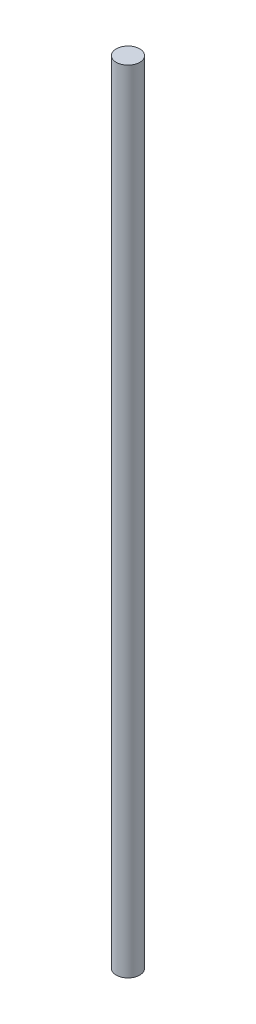
ISO-10303-21;
HEADER;
FILE_DESCRIPTION(('STEP AP214'),'2;1');
FILE_NAME('part.step','',(''),(''),'','','');
FILE_SCHEMA(('AUTOMOTIVE_DESIGN { 1 0 10303 214 1 1 1 1 }'));
ENDSEC;
DATA;
#1=APPLICATION_CONTEXT('core data for automotive mechanical design processes');
#2=APPLICATION_PROTOCOL_DEFINITION('international standard','automotive_design',2000,#1);
#3=PRODUCT_CONTEXT('',#1,'mechanical');
#4=PRODUCT('Part','Part','',(#3));
#5=PRODUCT_RELATED_PRODUCT_CATEGORY('part','',(#4));
#6=PRODUCT_DEFINITION_FORMATION('','',#4);
#7=PRODUCT_DEFINITION_CONTEXT('part definition',#1,'design');
#8=PRODUCT_DEFINITION('design','',#6,#7);
#9=PRODUCT_DEFINITION_SHAPE('','',#8);
#10=(LENGTH_UNIT() NAMED_UNIT(*) SI_UNIT(.MILLI.,.METRE.));
#11=(NAMED_UNIT(*) PLANE_ANGLE_UNIT() SI_UNIT($,.RADIAN.));
#12=(NAMED_UNIT(*) SI_UNIT($,.STERADIAN.) SOLID_ANGLE_UNIT());
#13=UNCERTAINTY_MEASURE_WITH_UNIT(LENGTH_MEASURE(1.E-05),#10,'distance_accuracy_value','');
#14=(GEOMETRIC_REPRESENTATION_CONTEXT(3) GLOBAL_UNCERTAINTY_ASSIGNED_CONTEXT((#13)) GLOBAL_UNIT_ASSIGNED_CONTEXT((#10,
#11,#12)) REPRESENTATION_CONTEXT('',''));
#15=CARTESIAN_POINT('',(0.,0.,0.));
#16=DIRECTION('',(0.,0.,1.));
#17=DIRECTION('',(1.,0.,0.));
#18=AXIS2_PLACEMENT_3D('',#15,#16,#17);
#19=CARTESIAN_POINT('',(0.,270.,0.));
#20=DIRECTION('',(0.,-1.,0.));
#21=DIRECTION('',(0.,0.,-1.));
#22=AXIS2_PLACEMENT_3D('',#19,#20,#21);
#23=CYLINDRICAL_SURFACE('',#22,4.);
#24=CARTESIAN_POINT('',(0.,270.,0.));
#25=DIRECTION('',(0.,1.,0.));
#26=DIRECTION('',(0.,0.,1.));
#27=AXIS2_PLACEMENT_3D('',#24,#25,#26);
#28=CIRCLE('',#27,4.);
#29=CARTESIAN_POINT('',(0.,270.,4.));
#30=VERTEX_POINT('',#29);
#31=EDGE_CURVE('E10',#30,#30,#28,.T.);
#32=ORIENTED_EDGE('',*,*,#31,.F.);
#33=EDGE_LOOP('',(#32));
#34=FACE_BOUND('',#33,.T.);
#35=CARTESIAN_POINT('',(0.,0.,0.));
#36=DIRECTION('',(0.,1.,0.));
#37=DIRECTION('',(0.,0.,1.));
#38=AXIS2_PLACEMENT_3D('',#35,#36,#37);
#39=CIRCLE('',#38,4.);
#40=CARTESIAN_POINT('',(0.,0.,4.));
#41=VERTEX_POINT('',#40);
#42=EDGE_CURVE('E36',#41,#41,#39,.T.);
#43=ORIENTED_EDGE('',*,*,#42,.T.);
#44=EDGE_LOOP('',(#43));
#45=FACE_BOUND('',#44,.T.);
#46=ADVANCED_FACE('F33',(#34,#45),#23,.T.);
#47=CARTESIAN_POINT('',(0.,270.,0.));
#48=DIRECTION('',(0.,1.,0.));
#49=DIRECTION('',(0.,0.,1.));
#50=AXIS2_PLACEMENT_3D('',#47,#48,#49);
#51=PLANE('',#50);
#52=ORIENTED_EDGE('',*,*,#31,.T.);
#53=EDGE_LOOP('',(#52));
#54=FACE_BOUND('',#53,.T.);
#55=ADVANCED_FACE('F48',(#54),#51,.T.);
#56=CARTESIAN_POINT('',(0.,0.,0.));
#57=DIRECTION('',(0.,1.,0.));
#58=DIRECTION('',(0.,0.,1.));
#59=AXIS2_PLACEMENT_3D('',#56,#57,#58);
#60=PLANE('',#59);
#61=ORIENTED_EDGE('',*,*,#42,.F.);
#62=EDGE_LOOP('',(#61));
#63=FACE_BOUND('',#62,.T.);
#64=ADVANCED_FACE('F46',(#63),#60,.F.);
#65=CLOSED_SHELL('',(#46,#55,#64));
#66=MANIFOLD_SOLID_BREP('B2',#65);
#67=ADVANCED_BREP_SHAPE_REPRESENTATION('',(#18,#66),#14);
#68=SHAPE_DEFINITION_REPRESENTATION(#9,#67);
ENDSEC;
END-ISO-10303-21;
